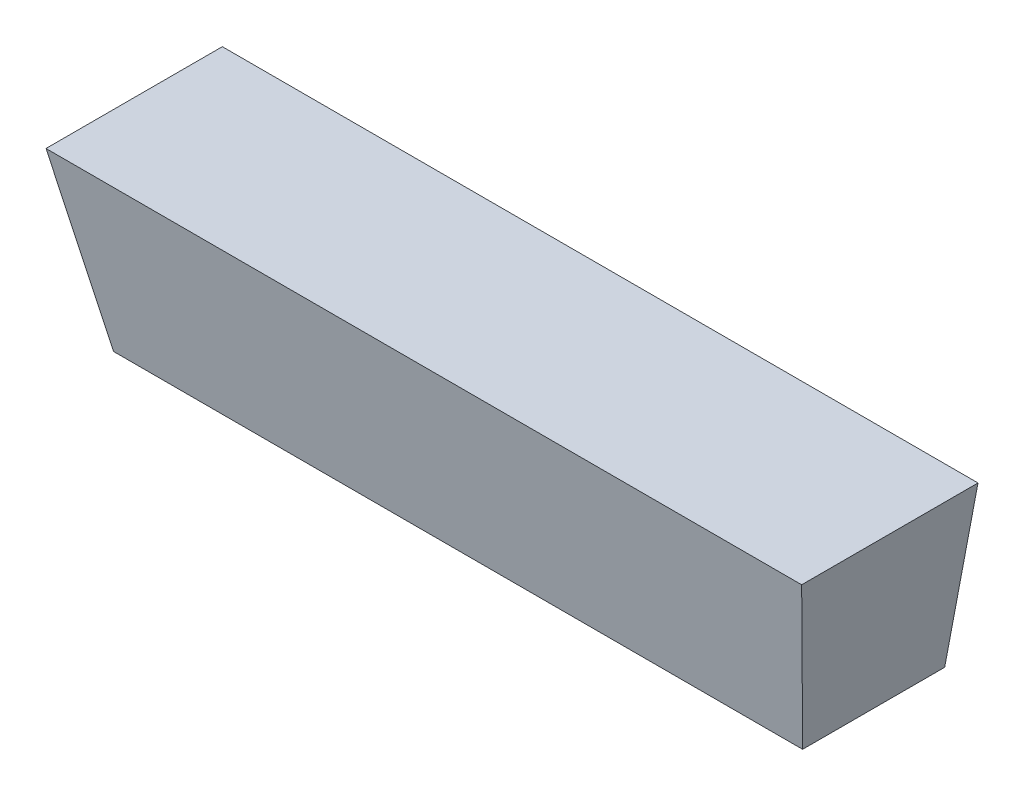
ISO-10303-21;
HEADER;
FILE_DESCRIPTION(('STEP AP214'),'2;1');
FILE_NAME('part.step','',(''),(''),'','','');
FILE_SCHEMA(('AUTOMOTIVE_DESIGN { 1 0 10303 214 1 1 1 1 }'));
ENDSEC;
DATA;
#1=APPLICATION_CONTEXT('core data for automotive mechanical design processes');
#2=APPLICATION_PROTOCOL_DEFINITION('international standard','automotive_design',2000,#1);
#3=PRODUCT_CONTEXT('',#1,'mechanical');
#4=PRODUCT('Part','Part','',(#3));
#5=PRODUCT_RELATED_PRODUCT_CATEGORY('part','',(#4));
#6=PRODUCT_DEFINITION_FORMATION('','',#4);
#7=PRODUCT_DEFINITION_CONTEXT('part definition',#1,'design');
#8=PRODUCT_DEFINITION('design','',#6,#7);
#9=PRODUCT_DEFINITION_SHAPE('','',#8);
#10=(LENGTH_UNIT() NAMED_UNIT(*) SI_UNIT(.MILLI.,.METRE.));
#11=(NAMED_UNIT(*) PLANE_ANGLE_UNIT() SI_UNIT($,.RADIAN.));
#12=(NAMED_UNIT(*) SI_UNIT($,.STERADIAN.) SOLID_ANGLE_UNIT());
#13=UNCERTAINTY_MEASURE_WITH_UNIT(LENGTH_MEASURE(1.E-05),#10,'distance_accuracy_value','');
#14=(GEOMETRIC_REPRESENTATION_CONTEXT(3) GLOBAL_UNCERTAINTY_ASSIGNED_CONTEXT((#13)) GLOBAL_UNIT_ASSIGNED_CONTEXT((#10,
#11,#12)) REPRESENTATION_CONTEXT('',''));
#15=CARTESIAN_POINT('',(0.,0.,0.));
#16=DIRECTION('',(0.,0.,1.));
#17=DIRECTION('',(1.,0.,0.));
#18=AXIS2_PLACEMENT_3D('',#15,#16,#17);
#19=CARTESIAN_POINT('',(0.,0.,0.));
#20=DIRECTION('',(0.,-1.,0.));
#21=DIRECTION('',(0.,0.,-1.));
#22=AXIS2_PLACEMENT_3D('',#19,#20,#21);
#23=PLANE('',#22);
#24=DIRECTION('',(1.,0.,0.));
#25=VECTOR('',#24,1.);
#26=CARTESIAN_POINT('',(190.5,0.,35.8097952588286));
#27=LINE('',#26,#25);
#28=CARTESIAN_POINT('',(182.10108530754,0.,35.8097952588286));
#29=VERTEX_POINT('',#28);
#30=CARTESIAN_POINT('',(8.39891469246012,0.,35.8097952588286));
#31=VERTEX_POINT('',#30);
#32=EDGE_CURVE('E61',#29,#31,#27,.F.);
#33=ORIENTED_EDGE('',*,*,#32,.T.);
#34=DIRECTION('',(0.,0.,1.));
#35=VECTOR('',#34,1.);
#36=CARTESIAN_POINT('',(8.39891469246064,1.94289029309402E-13,0.));
#37=LINE('',#36,#35);
#38=CARTESIAN_POINT('',(8.39891469245986,0.,0.));
#39=VERTEX_POINT('',#38);
#40=EDGE_CURVE('E55',#31,#39,#37,.F.);
#41=ORIENTED_EDGE('',*,*,#40,.T.);
#42=DIRECTION('',(1.,0.,0.));
#43=VECTOR('',#42,1.);
#44=CARTESIAN_POINT('',(0.,0.,0.));
#45=LINE('',#44,#43);
#46=CARTESIAN_POINT('',(182.10108530754,0.,0.));
#47=VERTEX_POINT('',#46);
#48=EDGE_CURVE('E20',#39,#47,#45,.T.);
#49=ORIENTED_EDGE('',*,*,#48,.T.);
#50=DIRECTION('',(0.,0.,1.));
#51=VECTOR('',#50,1.);
#52=CARTESIAN_POINT('',(182.10108530754,0.,0.));
#53=LINE('',#52,#51);
#54=EDGE_CURVE('E81',#47,#29,#53,.T.);
#55=ORIENTED_EDGE('',*,*,#54,.T.);
#56=EDGE_LOOP('',(#33,#41,#49,#55));
#57=FACE_BOUND('',#56,.T.);
#58=ADVANCED_FACE('F17',(#57),#23,.T.);
#59=CARTESIAN_POINT('',(0.,0.,0.));
#60=DIRECTION('',(0.,0.,1.));
#61=DIRECTION('',(1.,0.,0.));
#62=AXIS2_PLACEMENT_3D('',#59,#60,#61);
#63=PLANE('',#62);
#64=DIRECTION('',(-0.185666615385602,-0.982612796543611,0.));
#65=VECTOR('',#64,1.);
#66=CARTESIAN_POINT('',(182.10108530754,0.,0.));
#67=LINE('',#66,#65);
#68=CARTESIAN_POINT('',(190.5,44.4499999999999,0.));
#69=VERTEX_POINT('',#68);
#70=EDGE_CURVE('E68',#69,#47,#67,.T.);
#71=ORIENTED_EDGE('',*,*,#70,.T.);
#72=ORIENTED_EDGE('',*,*,#48,.F.);
#73=DIRECTION('',(-0.185666615385602,0.982612796543611,0.));
#74=VECTOR('',#73,1.);
#75=CARTESIAN_POINT('',(0.,44.45,0.));
#76=LINE('',#75,#74);
#77=CARTESIAN_POINT('',(0.,44.45,0.));
#78=VERTEX_POINT('',#77);
#79=EDGE_CURVE('E63',#39,#78,#76,.T.);
#80=ORIENTED_EDGE('',*,*,#79,.T.);
#81=DIRECTION('',(1.,0.,0.));
#82=VECTOR('',#81,1.);
#83=CARTESIAN_POINT('',(190.5,44.45,0.));
#84=LINE('',#83,#82);
#85=EDGE_CURVE('E83',#69,#78,#84,.F.);
#86=ORIENTED_EDGE('',*,*,#85,.F.);
#87=EDGE_LOOP('',(#71,#72,#80,#86));
#88=FACE_BOUND('',#87,.T.);
#89=ADVANCED_FACE('F65',(#88),#63,.F.);
#90=CARTESIAN_POINT('',(0.,44.45,0.));
#91=DIRECTION('',(0.982612796543611,0.185666615385602,0.));
#92=DIRECTION('',(-0.185666615385602,0.982612796543611,0.));
#93=AXIS2_PLACEMENT_3D('',#90,#91,#92);
#94=PLANE('',#93);
#95=ORIENTED_EDGE('',*,*,#79,.F.);
#96=ORIENTED_EDGE('',*,*,#40,.F.);
#97=DIRECTION('',(-0.182369875441916,0.965165293400467,0.187609128100129));
#98=VECTOR('',#97,1.);
#99=CARTESIAN_POINT('',(8.3989146924596,0.,35.8097952588286));
#100=LINE('',#99,#98);
#101=CARTESIAN_POINT('',(0.,44.4500000000001,44.4499999999995));
#102=VERTEX_POINT('',#101);
#103=EDGE_CURVE('E74',#31,#102,#100,.T.);
#104=ORIENTED_EDGE('',*,*,#103,.T.);
#105=DIRECTION('',(0.,0.,1.));
#106=VECTOR('',#105,1.);
#107=CARTESIAN_POINT('',(0.,44.45,0.));
#108=LINE('',#107,#106);
#109=EDGE_CURVE('E72',#78,#102,#108,.T.);
#110=ORIENTED_EDGE('',*,*,#109,.F.);
#111=EDGE_LOOP('',(#95,#96,#104,#110));
#112=FACE_BOUND('',#111,.T.);
#113=ADVANCED_FACE('F70',(#112),#94,.F.);
#114=CARTESIAN_POINT('',(190.5,0.,35.8097952588286));
#115=DIRECTION('',(0.,0.190808995376495,-0.981627183447674));
#116=DIRECTION('',(0.,0.981627183447674,0.190808995376495));
#117=AXIS2_PLACEMENT_3D('',#114,#115,#116);
#118=PLANE('',#117);
#119=DIRECTION('',(0.182369875441939,0.965165293400454,0.187609128100174));
#120=VECTOR('',#119,1.);
#121=CARTESIAN_POINT('',(182.10108530754,0.,35.8097952588286));
#122=LINE('',#121,#120);
#123=CARTESIAN_POINT('',(190.5,44.4500000000002,44.449999999999));
#124=VERTEX_POINT('',#123);
#125=EDGE_CURVE('E35',#29,#124,#122,.T.);
#126=ORIENTED_EDGE('',*,*,#125,.T.);
#127=DIRECTION('',(1.,0.,0.));
#128=VECTOR('',#127,1.);
#129=CARTESIAN_POINT('',(190.5,44.45,44.45));
#130=LINE('',#129,#128);
#131=EDGE_CURVE('E26',#102,#124,#130,.T.);
#132=ORIENTED_EDGE('',*,*,#131,.F.);
#133=ORIENTED_EDGE('',*,*,#103,.F.);
#134=ORIENTED_EDGE('',*,*,#32,.F.);
#135=EDGE_LOOP('',(#126,#132,#133,#134));
#136=FACE_BOUND('',#135,.T.);
#137=ADVANCED_FACE('F89',(#136),#118,.F.);
#138=CARTESIAN_POINT('',(182.10108530754,0.,0.));
#139=DIRECTION('',(-0.982612796543611,0.185666615385602,0.));
#140=DIRECTION('',(-0.185666615385602,-0.982612796543611,0.));
#141=AXIS2_PLACEMENT_3D('',#138,#139,#140);
#142=PLANE('',#141);
#143=ORIENTED_EDGE('',*,*,#70,.F.);
#144=DIRECTION('',(0.,0.,1.));
#145=VECTOR('',#144,1.);
#146=CARTESIAN_POINT('',(190.5,44.45,0.));
#147=LINE('',#146,#145);
#148=EDGE_CURVE('E11',#124,#69,#147,.F.);
#149=ORIENTED_EDGE('',*,*,#148,.F.);
#150=ORIENTED_EDGE('',*,*,#125,.F.);
#151=ORIENTED_EDGE('',*,*,#54,.F.);
#152=EDGE_LOOP('',(#143,#149,#150,#151));
#153=FACE_BOUND('',#152,.T.);
#154=ADVANCED_FACE('F91',(#153),#142,.F.);
#155=CARTESIAN_POINT('',(190.5,44.45,0.));
#156=DIRECTION('',(0.,1.,0.));
#157=DIRECTION('',(0.,0.,1.));
#158=AXIS2_PLACEMENT_3D('',#155,#156,#157);
#159=PLANE('',#158);
#160=ORIENTED_EDGE('',*,*,#131,.T.);
#161=ORIENTED_EDGE('',*,*,#148,.T.);
#162=ORIENTED_EDGE('',*,*,#85,.T.);
#163=ORIENTED_EDGE('',*,*,#109,.T.);
#164=EDGE_LOOP('',(#160,#161,#162,#163));
#165=FACE_BOUND('',#164,.T.);
#166=ADVANCED_FACE('F88',(#165),#159,.T.);
#167=CLOSED_SHELL('',(#58,#89,#113,#137,#154,#166));
#168=MANIFOLD_SOLID_BREP('B1',#167);
#169=ADVANCED_BREP_SHAPE_REPRESENTATION('',(#18,#168),#14);
#170=SHAPE_DEFINITION_REPRESENTATION(#9,#169);
ENDSEC;
END-ISO-10303-21;
